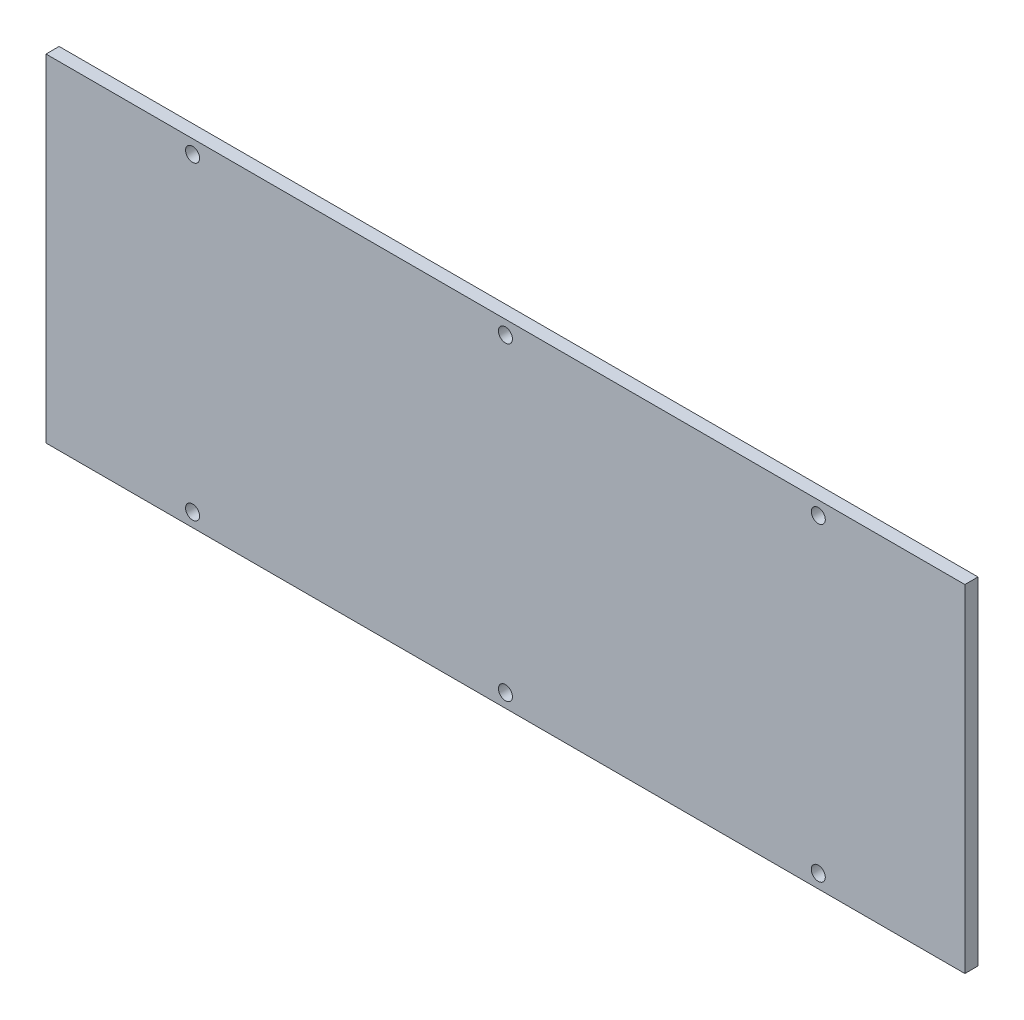
ISO-10303-21;
HEADER;
FILE_DESCRIPTION(('STEP AP214'),'2;1');
FILE_NAME('part.step','',(''),(''),'','','');
FILE_SCHEMA(('AUTOMOTIVE_DESIGN { 1 0 10303 214 1 1 1 1 }'));
ENDSEC;
DATA;
#1=APPLICATION_CONTEXT('core data for automotive mechanical design processes');
#2=APPLICATION_PROTOCOL_DEFINITION('international standard','automotive_design',2000,#1);
#3=PRODUCT_CONTEXT('',#1,'mechanical');
#4=PRODUCT('Part','Part','',(#3));
#5=PRODUCT_RELATED_PRODUCT_CATEGORY('part','',(#4));
#6=PRODUCT_DEFINITION_FORMATION('','',#4);
#7=PRODUCT_DEFINITION_CONTEXT('part definition',#1,'design');
#8=PRODUCT_DEFINITION('design','',#6,#7);
#9=PRODUCT_DEFINITION_SHAPE('','',#8);
#10=(LENGTH_UNIT() NAMED_UNIT(*) SI_UNIT(.MILLI.,.METRE.));
#11=(NAMED_UNIT(*) PLANE_ANGLE_UNIT() SI_UNIT($,.RADIAN.));
#12=(NAMED_UNIT(*) SI_UNIT($,.STERADIAN.) SOLID_ANGLE_UNIT());
#13=UNCERTAINTY_MEASURE_WITH_UNIT(LENGTH_MEASURE(1.E-05),#10,'distance_accuracy_value','');
#14=(GEOMETRIC_REPRESENTATION_CONTEXT(3) GLOBAL_UNCERTAINTY_ASSIGNED_CONTEXT((#13)) GLOBAL_UNIT_ASSIGNED_CONTEXT((#10,
#11,#12)) REPRESENTATION_CONTEXT('',''));
#15=CARTESIAN_POINT('',(0.,0.,0.));
#16=DIRECTION('',(0.,0.,1.));
#17=DIRECTION('',(1.,0.,0.));
#18=AXIS2_PLACEMENT_3D('',#15,#16,#17);
#19=CARTESIAN_POINT('',(-105.,38.5,3.));
#20=DIRECTION('',(0.,0.,1.));
#21=DIRECTION('',(1.,0.,0.));
#22=AXIS2_PLACEMENT_3D('',#19,#20,#21);
#23=PLANE('',#22);
#24=CARTESIAN_POINT('',(0.,-35.4,3.));
#25=DIRECTION('',(0.,0.,1.));
#26=DIRECTION('',(-1.,0.,0.));
#27=AXIS2_PLACEMENT_3D('',#24,#25,#26);
#28=CIRCLE('',#27,1.6);
#29=CARTESIAN_POINT('',(-1.6,-35.4,3.));
#30=VERTEX_POINT('',#29);
#31=EDGE_CURVE('E131',#30,#30,#28,.T.);
#32=ORIENTED_EDGE('',*,*,#31,.F.);
#33=EDGE_LOOP('',(#32));
#34=FACE_BOUND('',#33,.T.);
#35=CARTESIAN_POINT('',(71.5,35.4,3.));
#36=DIRECTION('',(0.,0.,1.));
#37=DIRECTION('',(1.,0.,0.));
#38=AXIS2_PLACEMENT_3D('',#35,#36,#37);
#39=CIRCLE('',#38,1.60000000000001);
#40=CARTESIAN_POINT('',(73.1,35.4,3.));
#41=VERTEX_POINT('',#40);
#42=EDGE_CURVE('E119',#41,#41,#39,.T.);
#43=ORIENTED_EDGE('',*,*,#42,.F.);
#44=EDGE_LOOP('',(#43));
#45=FACE_BOUND('',#44,.T.);
#46=CARTESIAN_POINT('',(0.,35.4,3.));
#47=DIRECTION('',(0.,0.,1.));
#48=DIRECTION('',(1.,0.,0.));
#49=AXIS2_PLACEMENT_3D('',#46,#47,#48);
#50=CIRCLE('',#49,1.6);
#51=CARTESIAN_POINT('',(1.6,35.4,3.));
#52=VERTEX_POINT('',#51);
#53=EDGE_CURVE('E98',#52,#52,#50,.T.);
#54=ORIENTED_EDGE('',*,*,#53,.F.);
#55=EDGE_LOOP('',(#54));
#56=FACE_BOUND('',#55,.T.);
#57=DIRECTION('',(0.,-1.,0.));
#58=VECTOR('',#57,1.);
#59=CARTESIAN_POINT('',(-105.,-38.5,3.));
#60=LINE('',#59,#58);
#61=CARTESIAN_POINT('',(-105.,38.5,3.));
#62=VERTEX_POINT('',#61);
#63=CARTESIAN_POINT('',(-105.,-38.5,3.));
#64=VERTEX_POINT('',#63);
#65=EDGE_CURVE('E83',#62,#64,#60,.T.);
#66=ORIENTED_EDGE('',*,*,#65,.T.);
#67=DIRECTION('',(1.,0.,0.));
#68=VECTOR('',#67,1.);
#69=CARTESIAN_POINT('',(105.,-38.5,3.));
#70=LINE('',#69,#68);
#71=CARTESIAN_POINT('',(105.,-38.5,3.));
#72=VERTEX_POINT('',#71);
#73=EDGE_CURVE('E78',#64,#72,#70,.T.);
#74=ORIENTED_EDGE('',*,*,#73,.T.);
#75=DIRECTION('',(0.,1.,0.));
#76=VECTOR('',#75,1.);
#77=CARTESIAN_POINT('',(105.,-38.5,3.));
#78=LINE('',#77,#76);
#79=CARTESIAN_POINT('',(105.,38.5,3.));
#80=VERTEX_POINT('',#79);
#81=EDGE_CURVE('E81',#72,#80,#78,.T.);
#82=ORIENTED_EDGE('',*,*,#81,.T.);
#83=DIRECTION('',(-1.,0.,0.));
#84=VECTOR('',#83,1.);
#85=CARTESIAN_POINT('',(105.,38.5,3.));
#86=LINE('',#85,#84);
#87=EDGE_CURVE('E48',#80,#62,#86,.T.);
#88=ORIENTED_EDGE('',*,*,#87,.T.);
#89=EDGE_LOOP('',(#66,#74,#82,#88));
#90=FACE_BOUND('',#89,.T.);
#91=CARTESIAN_POINT('',(-71.5,35.4,3.));
#92=DIRECTION('',(0.,0.,1.));
#93=DIRECTION('',(1.,0.,0.));
#94=AXIS2_PLACEMENT_3D('',#91,#92,#93);
#95=CIRCLE('',#94,1.60000000000001);
#96=CARTESIAN_POINT('',(-69.9,35.4,3.));
#97=VERTEX_POINT('',#96);
#98=EDGE_CURVE('E113',#97,#97,#95,.T.);
#99=ORIENTED_EDGE('',*,*,#98,.F.);
#100=EDGE_LOOP('',(#99));
#101=FACE_BOUND('',#100,.T.);
#102=CARTESIAN_POINT('',(71.5,-35.4,3.));
#103=DIRECTION('',(0.,0.,1.));
#104=DIRECTION('',(-1.,0.,0.));
#105=AXIS2_PLACEMENT_3D('',#102,#103,#104);
#106=CIRCLE('',#105,1.60000000000001);
#107=CARTESIAN_POINT('',(69.9,-35.4,3.));
#108=VERTEX_POINT('',#107);
#109=EDGE_CURVE('E125',#108,#108,#106,.T.);
#110=ORIENTED_EDGE('',*,*,#109,.F.);
#111=EDGE_LOOP('',(#110));
#112=FACE_BOUND('',#111,.T.);
#113=CARTESIAN_POINT('',(-71.5,-35.4,3.));
#114=DIRECTION('',(0.,0.,1.));
#115=DIRECTION('',(-1.,0.,0.));
#116=AXIS2_PLACEMENT_3D('',#113,#114,#115);
#117=CIRCLE('',#116,1.60000000000001);
#118=CARTESIAN_POINT('',(-73.1,-35.4,3.));
#119=VERTEX_POINT('',#118);
#120=EDGE_CURVE('E137',#119,#119,#117,.T.);
#121=ORIENTED_EDGE('',*,*,#120,.F.);
#122=EDGE_LOOP('',(#121));
#123=FACE_BOUND('',#122,.T.);
#124=ADVANCED_FACE('F31',(#34,#45,#56,#90,#101,#112,#123),#23,.T.);
#125=CARTESIAN_POINT('',(-105.,38.5,0.));
#126=DIRECTION('',(0.,0.,1.));
#127=DIRECTION('',(1.,0.,0.));
#128=AXIS2_PLACEMENT_3D('',#125,#126,#127);
#129=PLANE('',#128);
#130=CARTESIAN_POINT('',(0.,-35.4,0.));
#131=DIRECTION('',(0.,0.,1.));
#132=DIRECTION('',(-1.,0.,0.));
#133=AXIS2_PLACEMENT_3D('',#130,#131,#132);
#134=CIRCLE('',#133,1.6);
#135=CARTESIAN_POINT('',(-1.6,-35.4,0.));
#136=VERTEX_POINT('',#135);
#137=EDGE_CURVE('E134',#136,#136,#134,.T.);
#138=ORIENTED_EDGE('',*,*,#137,.T.);
#139=EDGE_LOOP('',(#138));
#140=FACE_BOUND('',#139,.T.);
#141=CARTESIAN_POINT('',(71.5,35.4,0.));
#142=DIRECTION('',(0.,0.,1.));
#143=DIRECTION('',(1.,0.,0.));
#144=AXIS2_PLACEMENT_3D('',#141,#142,#143);
#145=CIRCLE('',#144,1.60000000000001);
#146=CARTESIAN_POINT('',(73.1,35.4,0.));
#147=VERTEX_POINT('',#146);
#148=EDGE_CURVE('E122',#147,#147,#145,.T.);
#149=ORIENTED_EDGE('',*,*,#148,.T.);
#150=EDGE_LOOP('',(#149));
#151=FACE_BOUND('',#150,.T.);
#152=CARTESIAN_POINT('',(0.,35.4,0.));
#153=DIRECTION('',(0.,0.,1.));
#154=DIRECTION('',(1.,0.,0.));
#155=AXIS2_PLACEMENT_3D('',#152,#153,#154);
#156=CIRCLE('',#155,1.6);
#157=CARTESIAN_POINT('',(1.6,35.4,0.));
#158=VERTEX_POINT('',#157);
#159=EDGE_CURVE('E110',#158,#158,#156,.T.);
#160=ORIENTED_EDGE('',*,*,#159,.T.);
#161=EDGE_LOOP('',(#160));
#162=FACE_BOUND('',#161,.T.);
#163=DIRECTION('',(0.,-1.,0.));
#164=VECTOR('',#163,1.);
#165=CARTESIAN_POINT('',(-105.,-38.5,0.));
#166=LINE('',#165,#164);
#167=CARTESIAN_POINT('',(-105.,38.5,0.));
#168=VERTEX_POINT('',#167);
#169=CARTESIAN_POINT('',(-105.,-38.5,0.));
#170=VERTEX_POINT('',#169);
#171=EDGE_CURVE('E95',#168,#170,#166,.T.);
#172=ORIENTED_EDGE('',*,*,#171,.F.);
#173=DIRECTION('',(-1.,0.,0.));
#174=VECTOR('',#173,1.);
#175=CARTESIAN_POINT('',(105.,38.5,0.));
#176=LINE('',#175,#174);
#177=CARTESIAN_POINT('',(105.,38.5,0.));
#178=VERTEX_POINT('',#177);
#179=EDGE_CURVE('E71',#178,#168,#176,.T.);
#180=ORIENTED_EDGE('',*,*,#179,.F.);
#181=DIRECTION('',(0.,1.,0.));
#182=VECTOR('',#181,1.);
#183=CARTESIAN_POINT('',(105.,-38.5,0.));
#184=LINE('',#183,#182);
#185=CARTESIAN_POINT('',(105.,-38.5,0.));
#186=VERTEX_POINT('',#185);
#187=EDGE_CURVE('E65',#186,#178,#184,.T.);
#188=ORIENTED_EDGE('',*,*,#187,.F.);
#189=DIRECTION('',(1.,0.,0.));
#190=VECTOR('',#189,1.);
#191=CARTESIAN_POINT('',(105.,-38.5,0.));
#192=LINE('',#191,#190);
#193=EDGE_CURVE('E87',#170,#186,#192,.T.);
#194=ORIENTED_EDGE('',*,*,#193,.F.);
#195=EDGE_LOOP('',(#172,#180,#188,#194));
#196=FACE_BOUND('',#195,.T.);
#197=CARTESIAN_POINT('',(-71.5,35.4,0.));
#198=DIRECTION('',(0.,0.,1.));
#199=DIRECTION('',(1.,0.,0.));
#200=AXIS2_PLACEMENT_3D('',#197,#198,#199);
#201=CIRCLE('',#200,1.60000000000001);
#202=CARTESIAN_POINT('',(-69.9,35.4,0.));
#203=VERTEX_POINT('',#202);
#204=EDGE_CURVE('E116',#203,#203,#201,.T.);
#205=ORIENTED_EDGE('',*,*,#204,.T.);
#206=EDGE_LOOP('',(#205));
#207=FACE_BOUND('',#206,.T.);
#208=CARTESIAN_POINT('',(71.5,-35.4,0.));
#209=DIRECTION('',(0.,0.,1.));
#210=DIRECTION('',(-1.,0.,0.));
#211=AXIS2_PLACEMENT_3D('',#208,#209,#210);
#212=CIRCLE('',#211,1.60000000000001);
#213=CARTESIAN_POINT('',(69.9,-35.4,0.));
#214=VERTEX_POINT('',#213);
#215=EDGE_CURVE('E128',#214,#214,#212,.T.);
#216=ORIENTED_EDGE('',*,*,#215,.T.);
#217=EDGE_LOOP('',(#216));
#218=FACE_BOUND('',#217,.T.);
#219=CARTESIAN_POINT('',(-71.5,-35.4,0.));
#220=DIRECTION('',(0.,0.,1.));
#221=DIRECTION('',(-1.,0.,0.));
#222=AXIS2_PLACEMENT_3D('',#219,#220,#221);
#223=CIRCLE('',#222,1.60000000000001);
#224=CARTESIAN_POINT('',(-73.1,-35.4,0.));
#225=VERTEX_POINT('',#224);
#226=EDGE_CURVE('E140',#225,#225,#223,.T.);
#227=ORIENTED_EDGE('',*,*,#226,.T.);
#228=EDGE_LOOP('',(#227));
#229=FACE_BOUND('',#228,.T.);
#230=ADVANCED_FACE('F106',(#140,#151,#162,#196,#207,#218,#229),#129,.F.);
#231=CARTESIAN_POINT('',(-105.,-38.5,3.));
#232=DIRECTION('',(1.,0.,0.));
#233=DIRECTION('',(0.,0.,-1.));
#234=AXIS2_PLACEMENT_3D('',#231,#232,#233);
#235=PLANE('',#234);
#236=ORIENTED_EDGE('',*,*,#171,.T.);
#237=DIRECTION('',(0.,0.,-1.));
#238=VECTOR('',#237,1.);
#239=CARTESIAN_POINT('',(-105.,-38.5,3.));
#240=LINE('',#239,#238);
#241=EDGE_CURVE('E11',#64,#170,#240,.T.);
#242=ORIENTED_EDGE('',*,*,#241,.F.);
#243=ORIENTED_EDGE('',*,*,#65,.F.);
#244=DIRECTION('',(0.,0.,-1.));
#245=VECTOR('',#244,1.);
#246=CARTESIAN_POINT('',(-105.,38.5,3.));
#247=LINE('',#246,#245);
#248=EDGE_CURVE('E91',#62,#168,#247,.T.);
#249=ORIENTED_EDGE('',*,*,#248,.T.);
#250=EDGE_LOOP('',(#236,#242,#243,#249));
#251=FACE_BOUND('',#250,.T.);
#252=ADVANCED_FACE('F33',(#251),#235,.F.);
#253=CARTESIAN_POINT('',(105.,-38.5,3.));
#254=DIRECTION('',(0.,1.,0.));
#255=DIRECTION('',(-1.,0.,0.));
#256=AXIS2_PLACEMENT_3D('',#253,#254,#255);
#257=PLANE('',#256);
#258=ORIENTED_EDGE('',*,*,#193,.T.);
#259=DIRECTION('',(0.,0.,-1.));
#260=VECTOR('',#259,1.);
#261=CARTESIAN_POINT('',(105.,-38.5,3.));
#262=LINE('',#261,#260);
#263=EDGE_CURVE('E40',#72,#186,#262,.T.);
#264=ORIENTED_EDGE('',*,*,#263,.F.);
#265=ORIENTED_EDGE('',*,*,#73,.F.);
#266=ORIENTED_EDGE('',*,*,#241,.T.);
#267=EDGE_LOOP('',(#258,#264,#265,#266));
#268=FACE_BOUND('',#267,.T.);
#269=ADVANCED_FACE('F86',(#268),#257,.F.);
#270=CARTESIAN_POINT('',(105.,-38.5,3.));
#271=DIRECTION('',(-1.,0.,0.));
#272=DIRECTION('',(0.,0.,1.));
#273=AXIS2_PLACEMENT_3D('',#270,#271,#272);
#274=PLANE('',#273);
#275=ORIENTED_EDGE('',*,*,#187,.T.);
#276=DIRECTION('',(0.,0.,-1.));
#277=VECTOR('',#276,1.);
#278=CARTESIAN_POINT('',(105.,38.5,3.));
#279=LINE('',#278,#277);
#280=EDGE_CURVE('E88',#80,#178,#279,.T.);
#281=ORIENTED_EDGE('',*,*,#280,.F.);
#282=ORIENTED_EDGE('',*,*,#81,.F.);
#283=ORIENTED_EDGE('',*,*,#263,.T.);
#284=EDGE_LOOP('',(#275,#281,#282,#283));
#285=FACE_BOUND('',#284,.T.);
#286=ADVANCED_FACE('F89',(#285),#274,.F.);
#287=CARTESIAN_POINT('',(105.,38.5,3.));
#288=DIRECTION('',(0.,-1.,0.));
#289=DIRECTION('',(1.,0.,0.));
#290=AXIS2_PLACEMENT_3D('',#287,#288,#289);
#291=PLANE('',#290);
#292=ORIENTED_EDGE('',*,*,#179,.T.);
#293=ORIENTED_EDGE('',*,*,#248,.F.);
#294=ORIENTED_EDGE('',*,*,#87,.F.);
#295=ORIENTED_EDGE('',*,*,#280,.T.);
#296=EDGE_LOOP('',(#292,#293,#294,#295));
#297=FACE_BOUND('',#296,.T.);
#298=ADVANCED_FACE('F103',(#297),#291,.F.);
#299=CARTESIAN_POINT('',(0.,35.4,3.));
#300=DIRECTION('',(0.,0.,-1.));
#301=DIRECTION('',(-1.,0.,0.));
#302=AXIS2_PLACEMENT_3D('',#299,#300,#301);
#303=CYLINDRICAL_SURFACE('',#302,1.6);
#304=ORIENTED_EDGE('',*,*,#53,.T.);
#305=EDGE_LOOP('',(#304));
#306=FACE_BOUND('',#305,.T.);
#307=ORIENTED_EDGE('',*,*,#159,.F.);
#308=EDGE_LOOP('',(#307));
#309=FACE_BOUND('',#308,.T.);
#310=ADVANCED_FACE('F160',(#306,#309),#303,.F.);
#311=CARTESIAN_POINT('',(-71.5,35.4,3.));
#312=DIRECTION('',(0.,0.,-1.));
#313=DIRECTION('',(-1.,0.,0.));
#314=AXIS2_PLACEMENT_3D('',#311,#312,#313);
#315=CYLINDRICAL_SURFACE('',#314,1.60000000000001);
#316=ORIENTED_EDGE('',*,*,#98,.T.);
#317=EDGE_LOOP('',(#316));
#318=FACE_BOUND('',#317,.T.);
#319=ORIENTED_EDGE('',*,*,#204,.F.);
#320=EDGE_LOOP('',(#319));
#321=FACE_BOUND('',#320,.T.);
#322=ADVANCED_FACE('F206',(#318,#321),#315,.F.);
#323=CARTESIAN_POINT('',(71.5,35.4,3.));
#324=DIRECTION('',(0.,0.,-1.));
#325=DIRECTION('',(-1.,0.,0.));
#326=AXIS2_PLACEMENT_3D('',#323,#324,#325);
#327=CYLINDRICAL_SURFACE('',#326,1.60000000000001);
#328=ORIENTED_EDGE('',*,*,#42,.T.);
#329=EDGE_LOOP('',(#328));
#330=FACE_BOUND('',#329,.T.);
#331=ORIENTED_EDGE('',*,*,#148,.F.);
#332=EDGE_LOOP('',(#331));
#333=FACE_BOUND('',#332,.T.);
#334=ADVANCED_FACE('F214',(#330,#333),#327,.F.);
#335=CARTESIAN_POINT('',(71.5,-35.4,3.));
#336=DIRECTION('',(0.,0.,-1.));
#337=DIRECTION('',(-1.,0.,0.));
#338=AXIS2_PLACEMENT_3D('',#335,#336,#337);
#339=CYLINDRICAL_SURFACE('',#338,1.60000000000001);
#340=ORIENTED_EDGE('',*,*,#109,.T.);
#341=EDGE_LOOP('',(#340));
#342=FACE_BOUND('',#341,.T.);
#343=ORIENTED_EDGE('',*,*,#215,.F.);
#344=EDGE_LOOP('',(#343));
#345=FACE_BOUND('',#344,.T.);
#346=ADVANCED_FACE('F222',(#342,#345),#339,.F.);
#347=CARTESIAN_POINT('',(0.,-35.4,3.));
#348=DIRECTION('',(0.,0.,-1.));
#349=DIRECTION('',(-1.,0.,0.));
#350=AXIS2_PLACEMENT_3D('',#347,#348,#349);
#351=CYLINDRICAL_SURFACE('',#350,1.6);
#352=ORIENTED_EDGE('',*,*,#31,.T.);
#353=EDGE_LOOP('',(#352));
#354=FACE_BOUND('',#353,.T.);
#355=ORIENTED_EDGE('',*,*,#137,.F.);
#356=EDGE_LOOP('',(#355));
#357=FACE_BOUND('',#356,.T.);
#358=ADVANCED_FACE('F231',(#354,#357),#351,.F.);
#359=CARTESIAN_POINT('',(-71.5,-35.4,3.));
#360=DIRECTION('',(0.,0.,-1.));
#361=DIRECTION('',(-1.,0.,0.));
#362=AXIS2_PLACEMENT_3D('',#359,#360,#361);
#363=CYLINDRICAL_SURFACE('',#362,1.60000000000001);
#364=ORIENTED_EDGE('',*,*,#120,.T.);
#365=EDGE_LOOP('',(#364));
#366=FACE_BOUND('',#365,.T.);
#367=ORIENTED_EDGE('',*,*,#226,.F.);
#368=EDGE_LOOP('',(#367));
#369=FACE_BOUND('',#368,.T.);
#370=ADVANCED_FACE('F146',(#366,#369),#363,.F.);
#371=CLOSED_SHELL('',(#124,#230,#252,#269,#286,#298,#310,#322,#334,#346,#358,#370));
#372=MANIFOLD_SOLID_BREP('B2',#371);
#373=ADVANCED_BREP_SHAPE_REPRESENTATION('',(#18,#372),#14);
#374=SHAPE_DEFINITION_REPRESENTATION(#9,#373);
ENDSEC;
END-ISO-10303-21;
